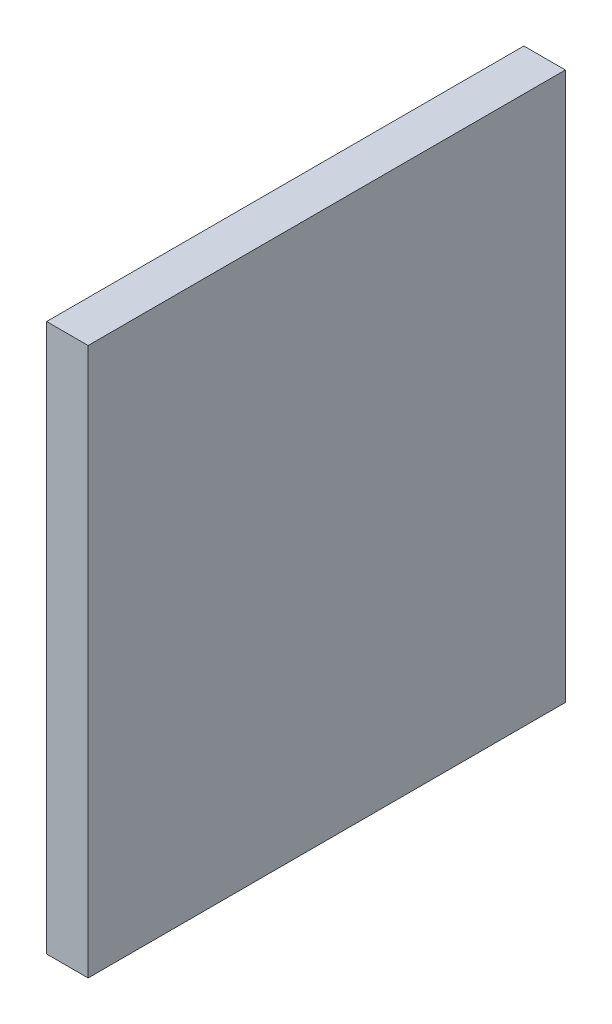
ISO-10303-21;
HEADER;
FILE_DESCRIPTION(('STEP AP214'),'2;1');
FILE_NAME('part.step','',(''),(''),'','','');
FILE_SCHEMA(('AUTOMOTIVE_DESIGN { 1 0 10303 214 1 1 1 1 }'));
ENDSEC;
DATA;
#1=APPLICATION_CONTEXT('core data for automotive mechanical design processes');
#2=APPLICATION_PROTOCOL_DEFINITION('international standard','automotive_design',2000,#1);
#3=PRODUCT_CONTEXT('',#1,'mechanical');
#4=PRODUCT('Part','Part','',(#3));
#5=PRODUCT_RELATED_PRODUCT_CATEGORY('part','',(#4));
#6=PRODUCT_DEFINITION_FORMATION('','',#4);
#7=PRODUCT_DEFINITION_CONTEXT('part definition',#1,'design');
#8=PRODUCT_DEFINITION('design','',#6,#7);
#9=PRODUCT_DEFINITION_SHAPE('','',#8);
#10=(LENGTH_UNIT() NAMED_UNIT(*) SI_UNIT(.MILLI.,.METRE.));
#11=(NAMED_UNIT(*) PLANE_ANGLE_UNIT() SI_UNIT($,.RADIAN.));
#12=(NAMED_UNIT(*) SI_UNIT($,.STERADIAN.) SOLID_ANGLE_UNIT());
#13=UNCERTAINTY_MEASURE_WITH_UNIT(LENGTH_MEASURE(1.E-05),#10,'distance_accuracy_value','');
#14=(GEOMETRIC_REPRESENTATION_CONTEXT(3) GLOBAL_UNCERTAINTY_ASSIGNED_CONTEXT((#13)) GLOBAL_UNIT_ASSIGNED_CONTEXT((#10,
#11,#12)) REPRESENTATION_CONTEXT('',''));
#15=CARTESIAN_POINT('',(0.,0.,0.));
#16=DIRECTION('',(0.,0.,1.));
#17=DIRECTION('',(1.,0.,0.));
#18=AXIS2_PLACEMENT_3D('',#15,#16,#17);
#19=CARTESIAN_POINT('',(3.175,-20.955,-18.25625));
#20=DIRECTION('',(0.,0.,1.));
#21=DIRECTION('',(1.,0.,0.));
#22=AXIS2_PLACEMENT_3D('',#19,#20,#21);
#23=PLANE('',#22);
#24=DIRECTION('',(0.,1.,0.));
#25=VECTOR('',#24,1.);
#26=CARTESIAN_POINT('',(0.,-20.955,-18.25625));
#27=LINE('',#26,#25);
#28=CARTESIAN_POINT('',(0.,-20.955,-18.25625));
#29=VERTEX_POINT('',#28);
#30=CARTESIAN_POINT('',(0.,20.955,-18.25625));
#31=VERTEX_POINT('',#30);
#32=EDGE_CURVE('E96',#29,#31,#27,.T.);
#33=ORIENTED_EDGE('',*,*,#32,.T.);
#34=DIRECTION('',(-1.,0.,0.));
#35=VECTOR('',#34,1.);
#36=CARTESIAN_POINT('',(3.175,20.955,-18.25625));
#37=LINE('',#36,#35);
#38=CARTESIAN_POINT('',(3.175,20.955,-18.25625));
#39=VERTEX_POINT('',#38);
#40=EDGE_CURVE('E11',#39,#31,#37,.T.);
#41=ORIENTED_EDGE('',*,*,#40,.F.);
#42=DIRECTION('',(0.,1.,0.));
#43=VECTOR('',#42,1.);
#44=CARTESIAN_POINT('',(3.175,-20.955,-18.25625));
#45=LINE('',#44,#43);
#46=CARTESIAN_POINT('',(3.175,-20.955,-18.25625));
#47=VERTEX_POINT('',#46);
#48=EDGE_CURVE('E84',#47,#39,#45,.T.);
#49=ORIENTED_EDGE('',*,*,#48,.F.);
#50=DIRECTION('',(-1.,0.,0.));
#51=VECTOR('',#50,1.);
#52=CARTESIAN_POINT('',(3.175,-20.955,-18.25625));
#53=LINE('',#52,#51);
#54=EDGE_CURVE('E92',#47,#29,#53,.T.);
#55=ORIENTED_EDGE('',*,*,#54,.T.);
#56=EDGE_LOOP('',(#33,#41,#49,#55));
#57=FACE_BOUND('',#56,.T.);
#58=ADVANCED_FACE('F33',(#57),#23,.F.);
#59=CARTESIAN_POINT('',(3.175,20.955,18.25625));
#60=DIRECTION('',(0.,-1.,0.));
#61=DIRECTION('',(0.,0.,-1.));
#62=AXIS2_PLACEMENT_3D('',#59,#60,#61);
#63=PLANE('',#62);
#64=DIRECTION('',(0.,0.,1.));
#65=VECTOR('',#64,1.);
#66=CARTESIAN_POINT('',(0.,20.955,18.25625));
#67=LINE('',#66,#65);
#68=CARTESIAN_POINT('',(0.,20.955,18.25625));
#69=VERTEX_POINT('',#68);
#70=EDGE_CURVE('E88',#31,#69,#67,.T.);
#71=ORIENTED_EDGE('',*,*,#70,.T.);
#72=DIRECTION('',(-1.,0.,0.));
#73=VECTOR('',#72,1.);
#74=CARTESIAN_POINT('',(3.175,20.955,18.25625));
#75=LINE('',#74,#73);
#76=CARTESIAN_POINT('',(3.175,20.955,18.25625));
#77=VERTEX_POINT('',#76);
#78=EDGE_CURVE('E41',#77,#69,#75,.T.);
#79=ORIENTED_EDGE('',*,*,#78,.F.);
#80=DIRECTION('',(0.,0.,1.));
#81=VECTOR('',#80,1.);
#82=CARTESIAN_POINT('',(3.175,20.955,18.25625));
#83=LINE('',#82,#81);
#84=EDGE_CURVE('E79',#39,#77,#83,.T.);
#85=ORIENTED_EDGE('',*,*,#84,.F.);
#86=ORIENTED_EDGE('',*,*,#40,.T.);
#87=EDGE_LOOP('',(#71,#79,#85,#86));
#88=FACE_BOUND('',#87,.T.);
#89=ADVANCED_FACE('F87',(#88),#63,.F.);
#90=CARTESIAN_POINT('',(3.175,-20.955,18.25625));
#91=DIRECTION('',(0.,0.,-1.));
#92=DIRECTION('',(-1.,0.,0.));
#93=AXIS2_PLACEMENT_3D('',#90,#91,#92);
#94=PLANE('',#93);
#95=DIRECTION('',(0.,-1.,0.));
#96=VECTOR('',#95,1.);
#97=CARTESIAN_POINT('',(0.,-20.955,18.25625));
#98=LINE('',#97,#96);
#99=CARTESIAN_POINT('',(0.,-20.955,18.25625));
#100=VERTEX_POINT('',#99);
#101=EDGE_CURVE('E66',#69,#100,#98,.T.);
#102=ORIENTED_EDGE('',*,*,#101,.T.);
#103=DIRECTION('',(-1.,0.,0.));
#104=VECTOR('',#103,1.);
#105=CARTESIAN_POINT('',(3.175,-20.955,18.25625));
#106=LINE('',#105,#104);
#107=CARTESIAN_POINT('',(3.175,-20.955,18.25625));
#108=VERTEX_POINT('',#107);
#109=EDGE_CURVE('E89',#108,#100,#106,.T.);
#110=ORIENTED_EDGE('',*,*,#109,.F.);
#111=DIRECTION('',(0.,-1.,0.));
#112=VECTOR('',#111,1.);
#113=CARTESIAN_POINT('',(3.175,-20.955,18.25625));
#114=LINE('',#113,#112);
#115=EDGE_CURVE('E82',#77,#108,#114,.T.);
#116=ORIENTED_EDGE('',*,*,#115,.F.);
#117=ORIENTED_EDGE('',*,*,#78,.T.);
#118=EDGE_LOOP('',(#102,#110,#116,#117));
#119=FACE_BOUND('',#118,.T.);
#120=ADVANCED_FACE('F90',(#119),#94,.F.);
#121=CARTESIAN_POINT('',(3.175,-20.955,18.25625));
#122=DIRECTION('',(0.,1.,0.));
#123=DIRECTION('',(0.,0.,1.));
#124=AXIS2_PLACEMENT_3D('',#121,#122,#123);
#125=PLANE('',#124);
#126=DIRECTION('',(0.,0.,-1.));
#127=VECTOR('',#126,1.);
#128=CARTESIAN_POINT('',(0.,-20.955,18.25625));
#129=LINE('',#128,#127);
#130=EDGE_CURVE('E72',#100,#29,#129,.T.);
#131=ORIENTED_EDGE('',*,*,#130,.T.);
#132=ORIENTED_EDGE('',*,*,#54,.F.);
#133=DIRECTION('',(0.,0.,-1.));
#134=VECTOR('',#133,1.);
#135=CARTESIAN_POINT('',(3.175,-20.955,18.25625));
#136=LINE('',#135,#134);
#137=EDGE_CURVE('E49',#108,#47,#136,.T.);
#138=ORIENTED_EDGE('',*,*,#137,.F.);
#139=ORIENTED_EDGE('',*,*,#109,.T.);
#140=EDGE_LOOP('',(#131,#132,#138,#139));
#141=FACE_BOUND('',#140,.T.);
#142=ADVANCED_FACE('F103',(#141),#125,.F.);
#143=CARTESIAN_POINT('',(3.175,20.955,-18.25625));
#144=DIRECTION('',(-1.,0.,0.));
#145=DIRECTION('',(0.,0.,1.));
#146=AXIS2_PLACEMENT_3D('',#143,#144,#145);
#147=PLANE('',#146);
#148=ORIENTED_EDGE('',*,*,#48,.T.);
#149=ORIENTED_EDGE('',*,*,#84,.T.);
#150=ORIENTED_EDGE('',*,*,#115,.T.);
#151=ORIENTED_EDGE('',*,*,#137,.T.);
#152=EDGE_LOOP('',(#148,#149,#150,#151));
#153=FACE_BOUND('',#152,.T.);
#154=ADVANCED_FACE('F80',(#153),#147,.F.);
#155=CARTESIAN_POINT('',(0.,20.955,-18.25625));
#156=DIRECTION('',(-1.,0.,0.));
#157=DIRECTION('',(0.,0.,1.));
#158=AXIS2_PLACEMENT_3D('',#155,#156,#157);
#159=PLANE('',#158);
#160=ORIENTED_EDGE('',*,*,#32,.F.);
#161=ORIENTED_EDGE('',*,*,#130,.F.);
#162=ORIENTED_EDGE('',*,*,#101,.F.);
#163=ORIENTED_EDGE('',*,*,#70,.F.);
#164=EDGE_LOOP('',(#160,#161,#162,#163));
#165=FACE_BOUND('',#164,.T.);
#166=ADVANCED_FACE('F106',(#165),#159,.T.);
#167=CLOSED_SHELL('',(#58,#89,#120,#142,#154,#166));
#168=MANIFOLD_SOLID_BREP('B2',#167);
#169=ADVANCED_BREP_SHAPE_REPRESENTATION('',(#18,#168),#14);
#170=SHAPE_DEFINITION_REPRESENTATION(#9,#169);
ENDSEC;
END-ISO-10303-21;
